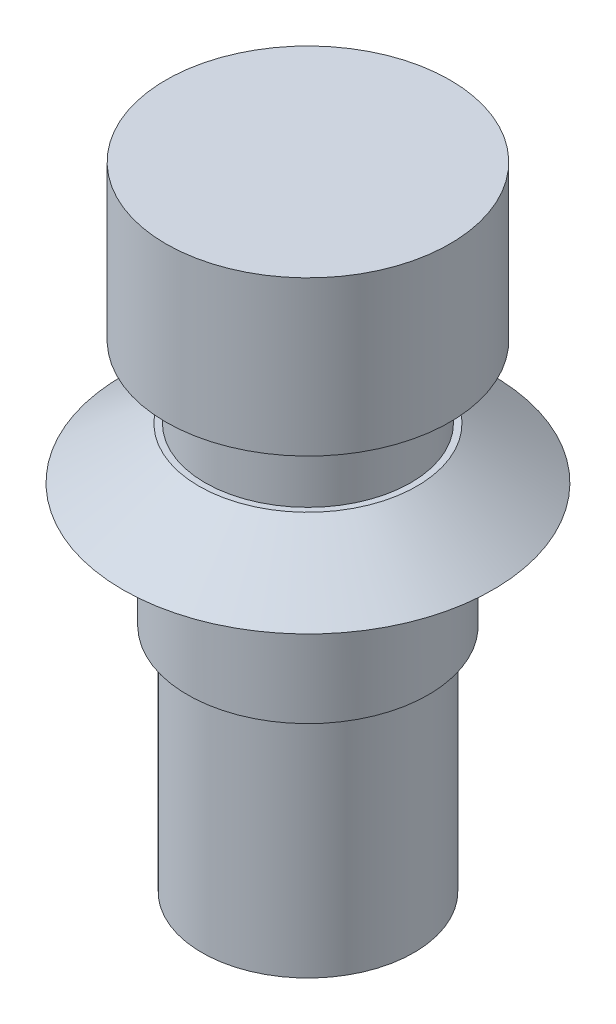
ISO-10303-21;
HEADER;
FILE_DESCRIPTION(('STEP AP214'),'2;1');
FILE_NAME('part.step','',(''),(''),'','','');
FILE_SCHEMA(('AUTOMOTIVE_DESIGN { 1 0 10303 214 1 1 1 1 }'));
ENDSEC;
DATA;
#1=APPLICATION_CONTEXT('core data for automotive mechanical design processes');
#2=APPLICATION_PROTOCOL_DEFINITION('international standard','automotive_design',2000,#1);
#3=PRODUCT_CONTEXT('',#1,'mechanical');
#4=PRODUCT('Part','Part','',(#3));
#5=PRODUCT_RELATED_PRODUCT_CATEGORY('part','',(#4));
#6=PRODUCT_DEFINITION_FORMATION('','',#4);
#7=PRODUCT_DEFINITION_CONTEXT('part definition',#1,'design');
#8=PRODUCT_DEFINITION('design','',#6,#7);
#9=PRODUCT_DEFINITION_SHAPE('','',#8);
#10=(LENGTH_UNIT() NAMED_UNIT(*) SI_UNIT(.MILLI.,.METRE.));
#11=(NAMED_UNIT(*) PLANE_ANGLE_UNIT() SI_UNIT($,.RADIAN.));
#12=(NAMED_UNIT(*) SI_UNIT($,.STERADIAN.) SOLID_ANGLE_UNIT());
#13=UNCERTAINTY_MEASURE_WITH_UNIT(LENGTH_MEASURE(1.E-05),#10,'distance_accuracy_value','');
#14=(GEOMETRIC_REPRESENTATION_CONTEXT(3) GLOBAL_UNCERTAINTY_ASSIGNED_CONTEXT((#13)) GLOBAL_UNIT_ASSIGNED_CONTEXT((#10,
#11,#12)) REPRESENTATION_CONTEXT('',''));
#15=CARTESIAN_POINT('',(0.,0.,0.));
#16=DIRECTION('',(0.,0.,1.));
#17=DIRECTION('',(1.,0.,0.));
#18=AXIS2_PLACEMENT_3D('',#15,#16,#17);
#19=CARTESIAN_POINT('',(0.,17.2,0.));
#20=DIRECTION('',(0.,-1.,0.));
#21=DIRECTION('',(0.,0.,-1.));
#22=AXIS2_PLACEMENT_3D('',#19,#20,#21);
#23=CYLINDRICAL_SURFACE('',#22,5.85);
#24=CARTESIAN_POINT('',(0.,17.2,0.));
#25=DIRECTION('',(0.,1.,0.));
#26=DIRECTION('',(0.,0.,1.));
#27=AXIS2_PLACEMENT_3D('',#24,#25,#26);
#28=CIRCLE('',#27,5.85);
#29=CARTESIAN_POINT('',(0.,17.2,5.85));
#30=VERTEX_POINT('',#29);
#31=EDGE_CURVE('E11',#30,#30,#28,.T.);
#32=ORIENTED_EDGE('',*,*,#31,.F.);
#33=EDGE_LOOP('',(#32));
#34=FACE_BOUND('',#33,.T.);
#35=CARTESIAN_POINT('',(0.,11.2,0.));
#36=DIRECTION('',(0.,-1.,0.));
#37=DIRECTION('',(0.,0.,-1.));
#38=AXIS2_PLACEMENT_3D('',#35,#36,#37);
#39=CIRCLE('',#38,5.85);
#40=CARTESIAN_POINT('',(0.,11.2,-5.85));
#41=VERTEX_POINT('',#40);
#42=EDGE_CURVE('E37',#41,#41,#39,.T.);
#43=ORIENTED_EDGE('',*,*,#42,.F.);
#44=EDGE_LOOP('',(#43));
#45=FACE_BOUND('',#44,.T.);
#46=ADVANCED_FACE('F34',(#34,#45),#23,.T.);
#47=CARTESIAN_POINT('',(0.,17.2,0.));
#48=DIRECTION('',(0.,-1.,0.));
#49=DIRECTION('',(0.,0.,1.));
#50=AXIS2_PLACEMENT_3D('',#47,#48,#49);
#51=CONICAL_SURFACE('',#50,9.,0.977384381116827);
#52=CARTESIAN_POINT('',(0.,19.7,0.));
#53=DIRECTION('',(0.,1.,0.));
#54=DIRECTION('',(0.,0.,1.));
#55=AXIS2_PLACEMENT_3D('',#52,#53,#54);
#56=CIRCLE('',#55,5.29359757871813);
#57=CARTESIAN_POINT('',(0.,19.7,5.29359757871813));
#58=VERTEX_POINT('',#57);
#59=EDGE_CURVE('E41',#58,#58,#56,.T.);
#60=ORIENTED_EDGE('',*,*,#59,.F.);
#61=EDGE_LOOP('',(#60));
#62=FACE_BOUND('',#61,.T.);
#63=CARTESIAN_POINT('',(0.,17.2,0.));
#64=DIRECTION('',(0.,1.,0.));
#65=DIRECTION('',(0.,0.,1.));
#66=AXIS2_PLACEMENT_3D('',#63,#64,#65);
#67=CIRCLE('',#66,9.);
#68=CARTESIAN_POINT('',(0.,17.2,9.));
#69=VERTEX_POINT('',#68);
#70=EDGE_CURVE('E45',#69,#69,#67,.T.);
#71=ORIENTED_EDGE('',*,*,#70,.T.);
#72=EDGE_LOOP('',(#71));
#73=FACE_BOUND('',#72,.T.);
#74=ADVANCED_FACE('F75',(#62,#73),#51,.T.);
#75=CARTESIAN_POINT('',(0.,19.7,0.));
#76=DIRECTION('',(0.,1.,0.));
#77=DIRECTION('',(0.,0.,1.));
#78=AXIS2_PLACEMENT_3D('',#75,#76,#77);
#79=PLANE('',#78);
#80=CARTESIAN_POINT('',(0.,19.7,0.));
#81=DIRECTION('',(0.,1.,0.));
#82=DIRECTION('',(0.,0.,1.));
#83=AXIS2_PLACEMENT_3D('',#80,#81,#82);
#84=CIRCLE('',#83,5.);
#85=CARTESIAN_POINT('',(0.,19.7,5.));
#86=VERTEX_POINT('',#85);
#87=EDGE_CURVE('E51',#86,#86,#84,.T.);
#88=ORIENTED_EDGE('',*,*,#87,.F.);
#89=EDGE_LOOP('',(#88));
#90=FACE_BOUND('',#89,.T.);
#91=ORIENTED_EDGE('',*,*,#59,.T.);
#92=EDGE_LOOP('',(#91));
#93=FACE_BOUND('',#92,.T.);
#94=ADVANCED_FACE('F82',(#90,#93),#79,.T.);
#95=CARTESIAN_POINT('',(0.,17.2,0.));
#96=DIRECTION('',(0.,1.,0.));
#97=DIRECTION('',(0.,0.,1.));
#98=AXIS2_PLACEMENT_3D('',#95,#96,#97);
#99=PLANE('',#98);
#100=ORIENTED_EDGE('',*,*,#31,.T.);
#101=EDGE_LOOP('',(#100));
#102=FACE_BOUND('',#101,.T.);
#103=ORIENTED_EDGE('',*,*,#70,.F.);
#104=EDGE_LOOP('',(#103));
#105=FACE_BOUND('',#104,.T.);
#106=ADVANCED_FACE('F88',(#102,#105),#99,.F.);
#107=CARTESIAN_POINT('',(0.,23.2,0.));
#108=DIRECTION('',(0.,-1.,0.));
#109=DIRECTION('',(0.,0.,-1.));
#110=AXIS2_PLACEMENT_3D('',#107,#108,#109);
#111=CYLINDRICAL_SURFACE('',#110,5.);
#112=CARTESIAN_POINT('',(0.,23.2,0.));
#113=DIRECTION('',(0.,1.,0.));
#114=DIRECTION('',(0.,0.,1.));
#115=AXIS2_PLACEMENT_3D('',#112,#113,#114);
#116=CIRCLE('',#115,5.);
#117=CARTESIAN_POINT('',(0.,23.2,5.));
#118=VERTEX_POINT('',#117);
#119=EDGE_CURVE('E50',#118,#118,#116,.T.);
#120=ORIENTED_EDGE('',*,*,#119,.F.);
#121=EDGE_LOOP('',(#120));
#122=FACE_BOUND('',#121,.T.);
#123=ORIENTED_EDGE('',*,*,#87,.T.);
#124=EDGE_LOOP('',(#123));
#125=FACE_BOUND('',#124,.T.);
#126=ADVANCED_FACE('F121',(#122,#125),#111,.T.);
#127=CARTESIAN_POINT('',(0.,30.7,0.));
#128=DIRECTION('',(0.,-1.,0.));
#129=DIRECTION('',(0.,0.,-1.));
#130=AXIS2_PLACEMENT_3D('',#127,#128,#129);
#131=CYLINDRICAL_SURFACE('',#130,6.9);
#132=CARTESIAN_POINT('',(0.,30.7,0.));
#133=DIRECTION('',(0.,1.,0.));
#134=DIRECTION('',(0.,0.,1.));
#135=AXIS2_PLACEMENT_3D('',#132,#133,#134);
#136=CIRCLE('',#135,6.9);
#137=CARTESIAN_POINT('',(0.,30.7,6.9));
#138=VERTEX_POINT('',#137);
#139=EDGE_CURVE('E54',#138,#138,#136,.T.);
#140=ORIENTED_EDGE('',*,*,#139,.F.);
#141=EDGE_LOOP('',(#140));
#142=FACE_BOUND('',#141,.T.);
#143=CARTESIAN_POINT('',(0.,23.2,0.));
#144=DIRECTION('',(0.,1.,0.));
#145=DIRECTION('',(0.,0.,1.));
#146=AXIS2_PLACEMENT_3D('',#143,#144,#145);
#147=CIRCLE('',#146,6.9);
#148=CARTESIAN_POINT('',(0.,23.2,6.9));
#149=VERTEX_POINT('',#148);
#150=EDGE_CURVE('E57',#149,#149,#147,.T.);
#151=ORIENTED_EDGE('',*,*,#150,.T.);
#152=EDGE_LOOP('',(#151));
#153=FACE_BOUND('',#152,.T.);
#154=ADVANCED_FACE('F114',(#142,#153),#131,.T.);
#155=CARTESIAN_POINT('',(0.,30.7,0.));
#156=DIRECTION('',(0.,1.,0.));
#157=DIRECTION('',(0.,0.,1.));
#158=AXIS2_PLACEMENT_3D('',#155,#156,#157);
#159=PLANE('',#158);
#160=ORIENTED_EDGE('',*,*,#139,.T.);
#161=EDGE_LOOP('',(#160));
#162=FACE_BOUND('',#161,.T.);
#163=ADVANCED_FACE('F111',(#162),#159,.T.);
#164=CARTESIAN_POINT('',(0.,23.2,0.));
#165=DIRECTION('',(0.,1.,0.));
#166=DIRECTION('',(0.,0.,1.));
#167=AXIS2_PLACEMENT_3D('',#164,#165,#166);
#168=PLANE('',#167);
#169=ORIENTED_EDGE('',*,*,#119,.T.);
#170=EDGE_LOOP('',(#169));
#171=FACE_BOUND('',#170,.T.);
#172=ORIENTED_EDGE('',*,*,#150,.F.);
#173=EDGE_LOOP('',(#172));
#174=FACE_BOUND('',#173,.T.);
#175=ADVANCED_FACE('F107',(#171,#174),#168,.F.);
#176=CARTESIAN_POINT('',(0.,11.2,0.));
#177=DIRECTION('',(0.,-1.,0.));
#178=DIRECTION('',(0.,0.,-1.));
#179=AXIS2_PLACEMENT_3D('',#176,#177,#178);
#180=PLANE('',#179);
#181=CARTESIAN_POINT('',(0.,11.2,0.));
#182=DIRECTION('',(0.,-1.,0.));
#183=DIRECTION('',(0.,0.,-1.));
#184=AXIS2_PLACEMENT_3D('',#181,#182,#183);
#185=CIRCLE('',#184,5.15);
#186=CARTESIAN_POINT('',(0.,11.2,-5.15));
#187=VERTEX_POINT('',#186);
#188=EDGE_CURVE('E65',#187,#187,#185,.T.);
#189=ORIENTED_EDGE('',*,*,#188,.F.);
#190=EDGE_LOOP('',(#189));
#191=FACE_BOUND('',#190,.T.);
#192=ORIENTED_EDGE('',*,*,#42,.T.);
#193=EDGE_LOOP('',(#192));
#194=FACE_BOUND('',#193,.T.);
#195=ADVANCED_FACE('F72',(#191,#194),#180,.T.);
#196=CARTESIAN_POINT('',(0.,11.2,0.));
#197=DIRECTION('',(0.,-1.,0.));
#198=DIRECTION('',(0.,0.,-1.));
#199=AXIS2_PLACEMENT_3D('',#196,#197,#198);
#200=CYLINDRICAL_SURFACE('',#199,5.15);
#201=ORIENTED_EDGE('',*,*,#188,.T.);
#202=EDGE_LOOP('',(#201));
#203=FACE_BOUND('',#202,.T.);
#204=CARTESIAN_POINT('',(0.,0.,0.));
#205=DIRECTION('',(0.,-1.,0.));
#206=DIRECTION('',(0.,0.,-1.));
#207=AXIS2_PLACEMENT_3D('',#204,#205,#206);
#208=CIRCLE('',#207,5.15);
#209=CARTESIAN_POINT('',(0.,0.,-5.15));
#210=VERTEX_POINT('',#209);
#211=EDGE_CURVE('E62',#210,#210,#208,.T.);
#212=ORIENTED_EDGE('',*,*,#211,.F.);
#213=EDGE_LOOP('',(#212));
#214=FACE_BOUND('',#213,.T.);
#215=ADVANCED_FACE('F96',(#203,#214),#200,.T.);
#216=CARTESIAN_POINT('',(0.,0.,0.));
#217=DIRECTION('',(0.,1.,0.));
#218=DIRECTION('',(0.,0.,1.));
#219=AXIS2_PLACEMENT_3D('',#216,#217,#218);
#220=PLANE('',#219);
#221=ORIENTED_EDGE('',*,*,#211,.T.);
#222=EDGE_LOOP('',(#221));
#223=FACE_BOUND('',#222,.T.);
#224=ADVANCED_FACE('F94',(#223),#220,.F.);
#225=CLOSED_SHELL('',(#46,#74,#94,#106,#126,#154,#163,#175,#195,#215,#224));
#226=MANIFOLD_SOLID_BREP('B2',#225);
#227=ADVANCED_BREP_SHAPE_REPRESENTATION('',(#18,#226),#14);
#228=SHAPE_DEFINITION_REPRESENTATION(#9,#227);
ENDSEC;
END-ISO-10303-21;
